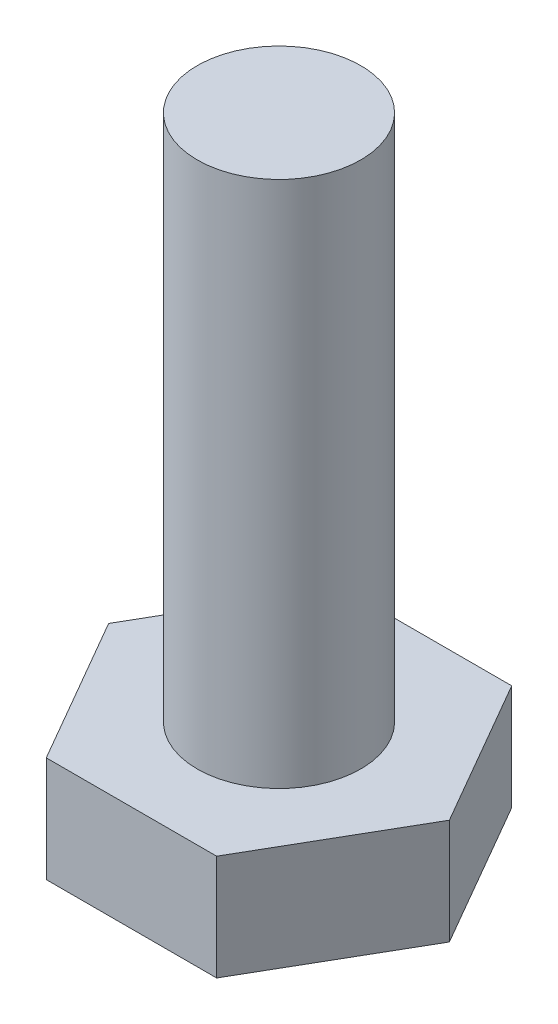
ISO-10303-21;
HEADER;
FILE_DESCRIPTION(('STEP AP214'),'2;1');
FILE_NAME('part.step','',(''),(''),'','','');
FILE_SCHEMA(('AUTOMOTIVE_DESIGN { 1 0 10303 214 1 1 1 1 }'));
ENDSEC;
DATA;
#1=APPLICATION_CONTEXT('core data for automotive mechanical design processes');
#2=APPLICATION_PROTOCOL_DEFINITION('international standard','automotive_design',2000,#1);
#3=PRODUCT_CONTEXT('',#1,'mechanical');
#4=PRODUCT('Part','Part','',(#3));
#5=PRODUCT_RELATED_PRODUCT_CATEGORY('part','',(#4));
#6=PRODUCT_DEFINITION_FORMATION('','',#4);
#7=PRODUCT_DEFINITION_CONTEXT('part definition',#1,'design');
#8=PRODUCT_DEFINITION('design','',#6,#7);
#9=PRODUCT_DEFINITION_SHAPE('','',#8);
#10=(LENGTH_UNIT() NAMED_UNIT(*) SI_UNIT(.MILLI.,.METRE.));
#11=(NAMED_UNIT(*) PLANE_ANGLE_UNIT() SI_UNIT($,.RADIAN.));
#12=(NAMED_UNIT(*) SI_UNIT($,.STERADIAN.) SOLID_ANGLE_UNIT());
#13=UNCERTAINTY_MEASURE_WITH_UNIT(LENGTH_MEASURE(1.E-05),#10,'distance_accuracy_value','');
#14=(GEOMETRIC_REPRESENTATION_CONTEXT(3) GLOBAL_UNCERTAINTY_ASSIGNED_CONTEXT((#13)) GLOBAL_UNIT_ASSIGNED_CONTEXT((#10,
#11,#12)) REPRESENTATION_CONTEXT('',''));
#15=CARTESIAN_POINT('',(0.,0.,0.));
#16=DIRECTION('',(0.,0.,1.));
#17=DIRECTION('',(1.,0.,0.));
#18=AXIS2_PLACEMENT_3D('',#15,#16,#17);
#19=CARTESIAN_POINT('',(1.61500000000003,2.,2.79726205422371));
#20=DIRECTION('',(-0.866025403784442,0.,-0.499999999999995));
#21=DIRECTION('',(-0.499999999999995,0.,0.866025403784442));
#22=AXIS2_PLACEMENT_3D('',#19,#20,#21);
#23=PLANE('',#22);
#24=DIRECTION('',(0.499999999999995,0.,-0.866025403784442));
#25=VECTOR('',#24,1.);
#26=CARTESIAN_POINT('',(1.61500000000003,0.,2.79726205422371));
#27=LINE('',#26,#25);
#28=CARTESIAN_POINT('',(1.61500000000003,0.,2.79726205422371));
#29=VERTEX_POINT('',#28);
#30=CARTESIAN_POINT('',(3.22999999999999,0.,0.));
#31=VERTEX_POINT('',#30);
#32=EDGE_CURVE('E117',#29,#31,#27,.T.);
#33=ORIENTED_EDGE('',*,*,#32,.T.);
#34=DIRECTION('',(0.,-1.,0.));
#35=VECTOR('',#34,1.);
#36=CARTESIAN_POINT('',(3.22999999999999,2.,0.));
#37=LINE('',#36,#35);
#38=CARTESIAN_POINT('',(3.22999999999999,2.,0.));
#39=VERTEX_POINT('',#38);
#40=EDGE_CURVE('E11',#39,#31,#37,.T.);
#41=ORIENTED_EDGE('',*,*,#40,.F.);
#42=DIRECTION('',(0.499999999999995,0.,-0.866025403784442));
#43=VECTOR('',#42,1.);
#44=CARTESIAN_POINT('',(1.61500000000003,2.,2.79726205422371));
#45=LINE('',#44,#43);
#46=CARTESIAN_POINT('',(1.61500000000003,2.,2.79726205422371));
#47=VERTEX_POINT('',#46);
#48=EDGE_CURVE('E128',#47,#39,#45,.T.);
#49=ORIENTED_EDGE('',*,*,#48,.F.);
#50=DIRECTION('',(0.,-1.,0.));
#51=VECTOR('',#50,1.);
#52=CARTESIAN_POINT('',(1.61500000000003,2.,2.79726205422371));
#53=LINE('',#52,#51);
#54=EDGE_CURVE('E113',#47,#29,#53,.T.);
#55=ORIENTED_EDGE('',*,*,#54,.T.);
#56=EDGE_LOOP('',(#33,#41,#49,#55));
#57=FACE_BOUND('',#56,.T.);
#58=ADVANCED_FACE('F33',(#57),#23,.F.);
#59=CARTESIAN_POINT('',(3.22999999999999,2.,0.));
#60=DIRECTION('',(-0.866025403784438,0.,0.500000000000001));
#61=DIRECTION('',(0.500000000000001,0.,0.866025403784438));
#62=AXIS2_PLACEMENT_3D('',#59,#60,#61);
#63=PLANE('',#62);
#64=DIRECTION('',(-0.500000000000001,0.,-0.866025403784438));
#65=VECTOR('',#64,1.);
#66=CARTESIAN_POINT('',(3.22999999999999,0.,0.));
#67=LINE('',#66,#65);
#68=CARTESIAN_POINT('',(1.61499999999999,0.,-2.79726205422373));
#69=VERTEX_POINT('',#68);
#70=EDGE_CURVE('E120',#31,#69,#67,.T.);
#71=ORIENTED_EDGE('',*,*,#70,.T.);
#72=DIRECTION('',(0.,-1.,0.));
#73=VECTOR('',#72,1.);
#74=CARTESIAN_POINT('',(1.61499999999999,2.,-2.79726205422373));
#75=LINE('',#74,#73);
#76=CARTESIAN_POINT('',(1.61499999999999,2.,-2.79726205422373));
#77=VERTEX_POINT('',#76);
#78=EDGE_CURVE('E41',#77,#69,#75,.T.);
#79=ORIENTED_EDGE('',*,*,#78,.F.);
#80=DIRECTION('',(-0.500000000000001,0.,-0.866025403784438));
#81=VECTOR('',#80,1.);
#82=CARTESIAN_POINT('',(3.22999999999999,2.,0.));
#83=LINE('',#82,#81);
#84=EDGE_CURVE('E86',#39,#77,#83,.T.);
#85=ORIENTED_EDGE('',*,*,#84,.F.);
#86=ORIENTED_EDGE('',*,*,#40,.T.);
#87=EDGE_LOOP('',(#71,#79,#85,#86));
#88=FACE_BOUND('',#87,.T.);
#89=ADVANCED_FACE('F153',(#88),#63,.F.);
#90=CARTESIAN_POINT('',(1.61499999999999,2.,-2.79726205422373));
#91=DIRECTION('',(0.,0.,1.));
#92=DIRECTION('',(1.,0.,0.));
#93=AXIS2_PLACEMENT_3D('',#90,#91,#92);
#94=PLANE('',#93);
#95=DIRECTION('',(-1.,0.,0.));
#96=VECTOR('',#95,1.);
#97=CARTESIAN_POINT('',(1.61499999999999,0.,-2.79726205422373));
#98=LINE('',#97,#96);
#99=CARTESIAN_POINT('',(-1.61500000000001,0.,-2.79726205422372));
#100=VERTEX_POINT('',#99);
#101=EDGE_CURVE('E123',#69,#100,#98,.T.);
#102=ORIENTED_EDGE('',*,*,#101,.T.);
#103=DIRECTION('',(0.,-1.,0.));
#104=VECTOR('',#103,1.);
#105=CARTESIAN_POINT('',(-1.61500000000001,2.,-2.79726205422372));
#106=LINE('',#105,#104);
#107=CARTESIAN_POINT('',(-1.61500000000001,2.,-2.79726205422372));
#108=VERTEX_POINT('',#107);
#109=EDGE_CURVE('E108',#108,#100,#106,.T.);
#110=ORIENTED_EDGE('',*,*,#109,.F.);
#111=DIRECTION('',(-1.,0.,0.));
#112=VECTOR('',#111,1.);
#113=CARTESIAN_POINT('',(1.61499999999999,2.,-2.79726205422373));
#114=LINE('',#113,#112);
#115=EDGE_CURVE('E99',#77,#108,#114,.T.);
#116=ORIENTED_EDGE('',*,*,#115,.F.);
#117=ORIENTED_EDGE('',*,*,#78,.T.);
#118=EDGE_LOOP('',(#102,#110,#116,#117));
#119=FACE_BOUND('',#118,.T.);
#120=ADVANCED_FACE('F134',(#119),#94,.F.);
#121=CARTESIAN_POINT('',(-1.61500000000001,2.,-2.79726205422372));
#122=DIRECTION('',(0.866025403784441,0.,0.499999999999995));
#123=DIRECTION('',(0.499999999999995,0.,-0.866025403784442));
#124=AXIS2_PLACEMENT_3D('',#121,#122,#123);
#125=PLANE('',#124);
#126=DIRECTION('',(-0.499999999999995,0.,0.866025403784441));
#127=VECTOR('',#126,1.);
#128=CARTESIAN_POINT('',(-1.61500000000001,0.,-2.79726205422372));
#129=LINE('',#128,#127);
#130=CARTESIAN_POINT('',(-3.22999999999999,0.,0.));
#131=VERTEX_POINT('',#130);
#132=EDGE_CURVE('E107',#100,#131,#129,.T.);
#133=ORIENTED_EDGE('',*,*,#132,.T.);
#134=DIRECTION('',(0.,-1.,0.));
#135=VECTOR('',#134,1.);
#136=CARTESIAN_POINT('',(-3.22999999999999,2.,0.));
#137=LINE('',#136,#135);
#138=CARTESIAN_POINT('',(-3.22999999999999,2.,0.));
#139=VERTEX_POINT('',#138);
#140=EDGE_CURVE('E104',#139,#131,#137,.T.);
#141=ORIENTED_EDGE('',*,*,#140,.F.);
#142=DIRECTION('',(-0.499999999999995,0.,0.866025403784441));
#143=VECTOR('',#142,1.);
#144=CARTESIAN_POINT('',(-1.61500000000001,2.,-2.79726205422372));
#145=LINE('',#144,#143);
#146=EDGE_CURVE('E93',#108,#139,#145,.T.);
#147=ORIENTED_EDGE('',*,*,#146,.F.);
#148=ORIENTED_EDGE('',*,*,#109,.T.);
#149=EDGE_LOOP('',(#133,#141,#147,#148));
#150=FACE_BOUND('',#149,.T.);
#151=ADVANCED_FACE('F105',(#150),#125,.F.);
#152=CARTESIAN_POINT('',(-3.22999999999999,2.,0.));
#153=DIRECTION('',(0.866025403784435,0.,-0.500000000000007));
#154=DIRECTION('',(-0.500000000000007,0.,-0.866025403784435));
#155=AXIS2_PLACEMENT_3D('',#152,#153,#154);
#156=PLANE('',#155);
#157=DIRECTION('',(0.500000000000007,0.,0.866025403784435));
#158=VECTOR('',#157,1.);
#159=CARTESIAN_POINT('',(-3.22999999999999,0.,0.));
#160=LINE('',#159,#158);
#161=CARTESIAN_POINT('',(-1.61499999999997,0.,2.79726205422375));
#162=VERTEX_POINT('',#161);
#163=EDGE_CURVE('E72',#131,#162,#160,.T.);
#164=ORIENTED_EDGE('',*,*,#163,.T.);
#165=DIRECTION('',(0.,-1.,0.));
#166=VECTOR('',#165,1.);
#167=CARTESIAN_POINT('',(-1.61499999999997,2.,2.79726205422375));
#168=LINE('',#167,#166);
#169=CARTESIAN_POINT('',(-1.61499999999997,2.,2.79726205422375));
#170=VERTEX_POINT('',#169);
#171=EDGE_CURVE('E109',#170,#162,#168,.T.);
#172=ORIENTED_EDGE('',*,*,#171,.F.);
#173=DIRECTION('',(0.500000000000007,0.,0.866025403784435));
#174=VECTOR('',#173,1.);
#175=CARTESIAN_POINT('',(-3.22999999999999,2.,0.));
#176=LINE('',#175,#174);
#177=EDGE_CURVE('E97',#139,#170,#176,.T.);
#178=ORIENTED_EDGE('',*,*,#177,.F.);
#179=ORIENTED_EDGE('',*,*,#140,.T.);
#180=EDGE_LOOP('',(#164,#172,#178,#179));
#181=FACE_BOUND('',#180,.T.);
#182=ADVANCED_FACE('F111',(#181),#156,.F.);
#183=CARTESIAN_POINT('',(-1.61499999999997,2.,2.79726205422375));
#184=DIRECTION('',(0.,0.,-1.));
#185=DIRECTION('',(-1.,0.,0.));
#186=AXIS2_PLACEMENT_3D('',#183,#184,#185);
#187=PLANE('',#186);
#188=DIRECTION('',(1.,0.,0.));
#189=VECTOR('',#188,1.);
#190=CARTESIAN_POINT('',(-1.61499999999997,0.,2.79726205422375));
#191=LINE('',#190,#189);
#192=EDGE_CURVE('E78',#162,#29,#191,.T.);
#193=ORIENTED_EDGE('',*,*,#192,.T.);
#194=ORIENTED_EDGE('',*,*,#54,.F.);
#195=DIRECTION('',(1.,0.,0.));
#196=VECTOR('',#195,1.);
#197=CARTESIAN_POINT('',(-1.61499999999997,2.,2.79726205422375));
#198=LINE('',#197,#196);
#199=EDGE_CURVE('E49',#170,#47,#198,.T.);
#200=ORIENTED_EDGE('',*,*,#199,.F.);
#201=ORIENTED_EDGE('',*,*,#171,.T.);
#202=EDGE_LOOP('',(#193,#194,#200,#201));
#203=FACE_BOUND('',#202,.T.);
#204=ADVANCED_FACE('F141',(#203),#187,.F.);
#205=CARTESIAN_POINT('',(0.,2.,0.));
#206=DIRECTION('',(0.,1.,0.));
#207=DIRECTION('',(0.,0.,1.));
#208=AXIS2_PLACEMENT_3D('',#205,#206,#207);
#209=PLANE('',#208);
#210=CARTESIAN_POINT('',(0.,2.,0.));
#211=DIRECTION('',(0.,1.,0.));
#212=DIRECTION('',(0.,0.,1.));
#213=AXIS2_PLACEMENT_3D('',#210,#211,#212);
#214=CIRCLE('',#213,1.55);
#215=CARTESIAN_POINT('',(0.,2.,1.55));
#216=VERTEX_POINT('',#215);
#217=EDGE_CURVE('E214',#216,#216,#214,.T.);
#218=ORIENTED_EDGE('',*,*,#217,.F.);
#219=EDGE_LOOP('',(#218));
#220=FACE_BOUND('',#219,.T.);
#221=ORIENTED_EDGE('',*,*,#48,.T.);
#222=ORIENTED_EDGE('',*,*,#84,.T.);
#223=ORIENTED_EDGE('',*,*,#115,.T.);
#224=ORIENTED_EDGE('',*,*,#146,.T.);
#225=ORIENTED_EDGE('',*,*,#177,.T.);
#226=ORIENTED_EDGE('',*,*,#199,.T.);
#227=EDGE_LOOP('',(#221,#222,#223,#224,#225,#226));
#228=FACE_BOUND('',#227,.T.);
#229=ADVANCED_FACE('F95',(#220,#228),#209,.T.);
#230=CARTESIAN_POINT('',(0.,0.,0.));
#231=DIRECTION('',(0.,1.,0.));
#232=DIRECTION('',(0.,0.,1.));
#233=AXIS2_PLACEMENT_3D('',#230,#231,#232);
#234=PLANE('',#233);
#235=ORIENTED_EDGE('',*,*,#32,.F.);
#236=ORIENTED_EDGE('',*,*,#192,.F.);
#237=ORIENTED_EDGE('',*,*,#163,.F.);
#238=ORIENTED_EDGE('',*,*,#132,.F.);
#239=ORIENTED_EDGE('',*,*,#101,.F.);
#240=ORIENTED_EDGE('',*,*,#70,.F.);
#241=EDGE_LOOP('',(#235,#236,#237,#238,#239,#240));
#242=FACE_BOUND('',#241,.T.);
#243=ADVANCED_FACE('F137',(#242),#234,.F.);
#244=CARTESIAN_POINT('',(0.,12.,0.));
#245=DIRECTION('',(0.,-1.,0.));
#246=DIRECTION('',(0.,0.,-1.));
#247=AXIS2_PLACEMENT_3D('',#244,#245,#246);
#248=CYLINDRICAL_SURFACE('',#247,1.55);
#249=CARTESIAN_POINT('',(0.,12.,0.));
#250=DIRECTION('',(0.,1.,0.));
#251=DIRECTION('',(0.,0.,1.));
#252=AXIS2_PLACEMENT_3D('',#249,#250,#251);
#253=CIRCLE('',#252,1.55);
#254=CARTESIAN_POINT('',(0.,12.,1.55));
#255=VERTEX_POINT('',#254);
#256=EDGE_CURVE('E121',#255,#255,#253,.T.);
#257=ORIENTED_EDGE('',*,*,#256,.F.);
#258=EDGE_LOOP('',(#257));
#259=FACE_BOUND('',#258,.T.);
#260=ORIENTED_EDGE('',*,*,#217,.T.);
#261=EDGE_LOOP('',(#260));
#262=FACE_BOUND('',#261,.T.);
#263=ADVANCED_FACE('F185',(#259,#262),#248,.T.);
#264=CARTESIAN_POINT('',(0.,12.,0.));
#265=DIRECTION('',(0.,1.,0.));
#266=DIRECTION('',(0.,0.,1.));
#267=AXIS2_PLACEMENT_3D('',#264,#265,#266);
#268=PLANE('',#267);
#269=ORIENTED_EDGE('',*,*,#256,.T.);
#270=EDGE_LOOP('',(#269));
#271=FACE_BOUND('',#270,.T.);
#272=ADVANCED_FACE('F198',(#271),#268,.T.);
#273=CLOSED_SHELL('',(#58,#89,#120,#151,#182,#204,#229,#243,#263,#272));
#274=MANIFOLD_SOLID_BREP('B2',#273);
#275=ADVANCED_BREP_SHAPE_REPRESENTATION('',(#18,#274),#14);
#276=SHAPE_DEFINITION_REPRESENTATION(#9,#275);
ENDSEC;
END-ISO-10303-21;
